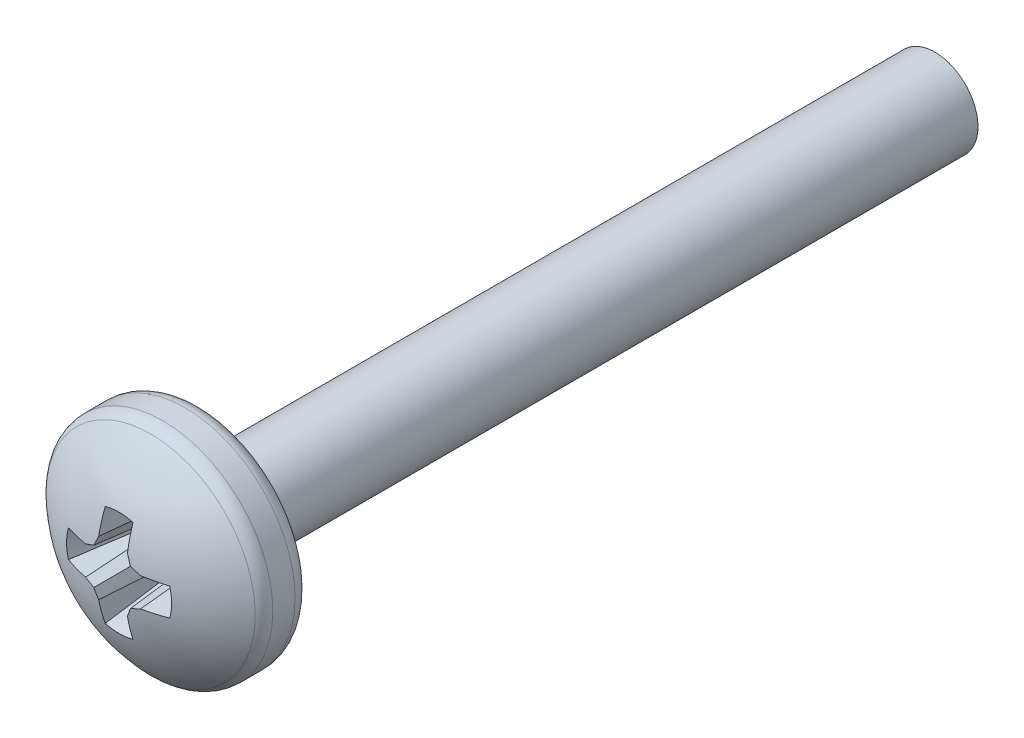
ISO-10303-21;
HEADER;
FILE_DESCRIPTION(('STEP AP214'),'2;1');
FILE_NAME('part.step','',(''),(''),'','','');
FILE_SCHEMA(('AUTOMOTIVE_DESIGN { 1 0 10303 214 1 1 1 1 }'));
ENDSEC;
DATA;
#1=APPLICATION_CONTEXT('core data for automotive mechanical design processes');
#2=APPLICATION_PROTOCOL_DEFINITION('international standard','automotive_design',2000,#1);
#3=PRODUCT_CONTEXT('',#1,'mechanical');
#4=PRODUCT('Part','Part','',(#3));
#5=PRODUCT_RELATED_PRODUCT_CATEGORY('part','',(#4));
#6=PRODUCT_DEFINITION_FORMATION('','',#4);
#7=PRODUCT_DEFINITION_CONTEXT('part definition',#1,'design');
#8=PRODUCT_DEFINITION('design','',#6,#7);
#9=PRODUCT_DEFINITION_SHAPE('','',#8);
#10=(LENGTH_UNIT() NAMED_UNIT(*) SI_UNIT(.MILLI.,.METRE.));
#11=(NAMED_UNIT(*) PLANE_ANGLE_UNIT() SI_UNIT($,.RADIAN.));
#12=(NAMED_UNIT(*) SI_UNIT($,.STERADIAN.) SOLID_ANGLE_UNIT());
#13=UNCERTAINTY_MEASURE_WITH_UNIT(LENGTH_MEASURE(1.E-05),#10,'distance_accuracy_value','');
#14=(GEOMETRIC_REPRESENTATION_CONTEXT(3) GLOBAL_UNCERTAINTY_ASSIGNED_CONTEXT((#13)) GLOBAL_UNIT_ASSIGNED_CONTEXT((#10,
#11,#12)) REPRESENTATION_CONTEXT('',''));
#15=CARTESIAN_POINT('',(0.,0.,0.));
#16=DIRECTION('',(0.,0.,1.));
#17=DIRECTION('',(1.,0.,0.));
#18=AXIS2_PLACEMENT_3D('',#15,#16,#17);
#19=CARTESIAN_POINT('',(0.,0.,20.));
#20=DIRECTION('',(0.,0.,-1.));
#21=DIRECTION('',(-1.,0.,0.));
#22=AXIS2_PLACEMENT_3D('',#19,#20,#21);
#23=PLANE('',#22);
#24=CARTESIAN_POINT('',(0.,0.,20.));
#25=DIRECTION('',(0.,0.,1.));
#26=DIRECTION('',(1.,0.,0.));
#27=AXIS2_PLACEMENT_3D('',#24,#25,#26);
#28=CIRCLE('',#27,1.17524047358083);
#29=CARTESIAN_POINT('',(1.17524047358083,0.,20.));
#30=VERTEX_POINT('',#29);
#31=EDGE_CURVE('E725',#30,#30,#28,.T.);
#32=ORIENTED_EDGE('',*,*,#31,.T.);
#33=EDGE_LOOP('',(#32));
#34=FACE_BOUND('',#33,.T.);
#35=CARTESIAN_POINT('',(0.,0.,20.));
#36=DIRECTION('',(0.,0.,1.));
#37=DIRECTION('',(0.,-1.,0.));
#38=AXIS2_PLACEMENT_3D('',#35,#36,#37);
#39=CIRCLE('',#38,2.55);
#40=CARTESIAN_POINT('',(0.,-2.55000000000001,20.));
#41=VERTEX_POINT('',#40);
#42=EDGE_CURVE('E711',#41,#41,#39,.T.);
#43=ORIENTED_EDGE('',*,*,#42,.F.);
#44=EDGE_LOOP('',(#43));
#45=FACE_BOUND('',#44,.T.);
#46=ADVANCED_FACE('F37',(#34,#45),#23,.T.);
#47=CARTESIAN_POINT('',(0.,0.,0.));
#48=DIRECTION('',(0.,0.,1.));
#49=DIRECTION('',(1.,0.,0.));
#50=AXIS2_PLACEMENT_3D('',#47,#48,#49);
#51=PLANE('',#50);
#52=CARTESIAN_POINT('',(0.,0.,0.));
#53=DIRECTION('',(0.,0.,1.));
#54=DIRECTION('',(1.,0.,0.));
#55=AXIS2_PLACEMENT_3D('',#52,#53,#54);
#56=CIRCLE('',#55,1.17524047358084);
#57=CARTESIAN_POINT('',(1.17524047358084,0.,0.));
#58=VERTEX_POINT('',#57);
#59=EDGE_CURVE('E387',#58,#58,#56,.T.);
#60=ORIENTED_EDGE('',*,*,#59,.F.);
#61=EDGE_LOOP('',(#60));
#62=FACE_BOUND('',#61,.T.);
#63=ADVANCED_FACE('F223',(#62),#51,.F.);
#64=CARTESIAN_POINT('',(0.,0.,0.));
#65=DIRECTION('',(0.,0.,1.));
#66=DIRECTION('',(1.,0.,0.));
#67=AXIS2_PLACEMENT_3D('',#64,#65,#66);
#68=CYLINDRICAL_SURFACE('',#67,1.17524047358084);
#69=ORIENTED_EDGE('',*,*,#31,.F.);
#70=EDGE_LOOP('',(#69));
#71=FACE_BOUND('',#70,.T.);
#72=ORIENTED_EDGE('',*,*,#59,.T.);
#73=EDGE_LOOP('',(#72));
#74=FACE_BOUND('',#73,.T.);
#75=ADVANCED_FACE('F229',(#71,#74),#68,.T.);
#76=CARTESIAN_POINT('',(0.,0.,20.45));
#77=DIRECTION('',(0.,0.,1.));
#78=DIRECTION('',(0.,-1.,0.));
#79=AXIS2_PLACEMENT_3D('',#76,#77,#78);
#80=TOROIDAL_SURFACE('',#79,2.55,0.449999999999999);
#81=ORIENTED_EDGE('',*,*,#42,.T.);
#82=EDGE_LOOP('',(#81));
#83=FACE_BOUND('',#82,.T.);
#84=CARTESIAN_POINT('',(0.,0.,20.45));
#85=DIRECTION('',(0.,0.,1.));
#86=DIRECTION('',(0.,-1.,0.));
#87=AXIS2_PLACEMENT_3D('',#84,#85,#86);
#88=CIRCLE('',#87,3.);
#89=CARTESIAN_POINT('',(0.,-3.00000000000001,20.45));
#90=VERTEX_POINT('',#89);
#91=EDGE_CURVE('E714',#90,#90,#88,.T.);
#92=ORIENTED_EDGE('',*,*,#91,.F.);
#93=EDGE_LOOP('',(#92));
#94=FACE_BOUND('',#93,.T.);
#95=ADVANCED_FACE('F240',(#83,#94),#80,.T.);
#96=CARTESIAN_POINT('',(0.,0.,0.));
#97=DIRECTION('',(0.,0.,-1.));
#98=DIRECTION('',(-1.,0.,0.));
#99=AXIS2_PLACEMENT_3D('',#96,#97,#98);
#100=CYLINDRICAL_SURFACE('',#99,2.99999999999999);
#101=ORIENTED_EDGE('',*,*,#91,.T.);
#102=EDGE_LOOP('',(#101));
#103=FACE_BOUND('',#102,.T.);
#104=CARTESIAN_POINT('',(0.,0.,21.0585454011027));
#105=DIRECTION('',(0.,0.,1.));
#106=DIRECTION('',(0.,-1.,0.));
#107=AXIS2_PLACEMENT_3D('',#104,#105,#106);
#108=CIRCLE('',#107,3.);
#109=CARTESIAN_POINT('',(0.,-3.00000000000001,21.0585454011027));
#110=VERTEX_POINT('',#109);
#111=EDGE_CURVE('E715',#110,#110,#108,.T.);
#112=ORIENTED_EDGE('',*,*,#111,.F.);
#113=EDGE_LOOP('',(#112));
#114=FACE_BOUND('',#113,.T.);
#115=ADVANCED_FACE('F237',(#103,#114),#100,.T.);
#116=CARTESIAN_POINT('',(0.,0.,18.275));
#117=DIRECTION('',(0.,0.,1.));
#118=DIRECTION('',(0.,1.,0.));
#119=AXIS2_PLACEMENT_3D('',#116,#117,#118);
#120=SPHERICAL_SURFACE('',#119,4.225);
#121=CARTESIAN_POINT('',(0.,0.,22.2495955953641));
#122=DIRECTION('',(0.,0.,-1.));
#123=DIRECTION('',(-1.,0.,0.));
#124=AXIS2_PLACEMENT_3D('',#121,#122,#123);
#125=CIRCLE('',#124,1.4329043419966);
#126=CARTESIAN_POINT('',(1.38212190130692,-0.378092453297411,22.2495955953641));
#127=VERTEX_POINT('',#126);
#128=CARTESIAN_POINT('',(1.38212190130692,0.378092453297393,22.2495955953641));
#129=VERTEX_POINT('',#128);
#130=EDGE_CURVE('E375',#127,#129,#125,.F.);
#131=ORIENTED_EDGE('',*,*,#130,.F.);
#132=CARTESIAN_POINT('',(0.,-0.0301297752810587,18.2723639862283));
#133=DIRECTION('',(0.,0.996194698091746,0.0871557427476588));
#134=DIRECTION('',(0.,-0.0871557427476588,0.996194698091746));
#135=AXIS2_PLACEMENT_3D('',#132,#133,#134);
#136=CIRCLE('',#135,4.22489174394716);
#137=CARTESIAN_POINT('',(0.74851378936592,-0.392528314585643,22.414598244924));
#138=VERTEX_POINT('',#137);
#139=EDGE_CURVE('E11',#138,#127,#136,.T.);
#140=ORIENTED_EDGE('',*,*,#139,.F.);
#141=CARTESIAN_POINT('',(0.108967296427391,-0.263070324890154,18.2500880170758));
#142=DIRECTION('',(-0.381227206369641,0.92036389196323,0.087155742747659));
#143=DIRECTION('',(-0.923879532511292,-0.382683432365078,0.));
#144=AXIS2_PLACEMENT_3D('',#141,#142,#143);
#145=CIRCLE('',#144,4.21532021625621);
#146=CARTESIAN_POINT('',(0.498545645256693,-0.498545645256698,22.4407567714872));
#147=VERTEX_POINT('',#146);
#148=EDGE_CURVE('E47',#147,#138,#145,.T.);
#149=ORIENTED_EDGE('',*,*,#148,.F.);
#150=CARTESIAN_POINT('',(0.263070324890149,-0.108967296427404,18.2500880170758));
#151=DIRECTION('',(-0.920363891963226,0.381227206369651,0.087155742747659));
#152=DIRECTION('',(-0.382683432365087,-0.923879532511288,0.));
#153=AXIS2_PLACEMENT_3D('',#150,#151,#152);
#154=CIRCLE('',#153,4.21532021625621);
#155=CARTESIAN_POINT('',(0.392528314585635,-0.748513789365924,22.414598244924));
#156=VERTEX_POINT('',#155);
#157=EDGE_CURVE('E396',#156,#147,#154,.T.);
#158=ORIENTED_EDGE('',*,*,#157,.F.);
#159=CARTESIAN_POINT('',(0.0301297752810564,0.,18.2723639862283));
#160=DIRECTION('',(-0.996194698091746,0.,0.0871557427476588));
#161=DIRECTION('',(0.0871557427476588,0.,0.996194698091746));
#162=AXIS2_PLACEMENT_3D('',#159,#160,#161);
#163=CIRCLE('',#162,4.22489174394716);
#164=CARTESIAN_POINT('',(0.378092453297399,-1.38212190130693,22.2495955953641));
#165=VERTEX_POINT('',#164);
#166=EDGE_CURVE('E355',#165,#156,#163,.T.);
#167=ORIENTED_EDGE('',*,*,#166,.F.);
#168=CARTESIAN_POINT('',(0.,0.,22.2495955953641));
#169=DIRECTION('',(0.,0.,-1.));
#170=DIRECTION('',(0.,1.,0.));
#171=AXIS2_PLACEMENT_3D('',#168,#169,#170);
#172=CIRCLE('',#171,1.4329043419966);
#173=CARTESIAN_POINT('',(-0.378092453297405,-1.38212190130693,22.2495955953641));
#174=VERTEX_POINT('',#173);
#175=EDGE_CURVE('E401',#174,#165,#172,.F.);
#176=ORIENTED_EDGE('',*,*,#175,.F.);
#177=CARTESIAN_POINT('',(-0.0301297752810505,0.,18.2723639862283));
#178=DIRECTION('',(0.996194698091746,0.,0.0871557427476584));
#179=DIRECTION('',(0.0871557427476584,0.,-0.996194698091746));
#180=AXIS2_PLACEMENT_3D('',#177,#178,#179);
#181=CIRCLE('',#180,4.22489174394716);
#182=CARTESIAN_POINT('',(-0.392528314585635,-0.748513789365929,22.414598244924));
#183=VERTEX_POINT('',#182);
#184=EDGE_CURVE('E335',#183,#174,#181,.T.);
#185=ORIENTED_EDGE('',*,*,#184,.F.);
#186=CARTESIAN_POINT('',(-0.263070324890146,-0.108967296427398,18.2500880170758));
#187=DIRECTION('',(0.920363891963231,0.381227206369638,0.0871557427476587));
#188=DIRECTION('',(-0.382683432365074,0.923879532511293,0.));
#189=AXIS2_PLACEMENT_3D('',#186,#187,#188);
#190=CIRCLE('',#189,4.21532021625621);
#191=CARTESIAN_POINT('',(-0.498545645256689,-0.498545645256701,22.4407567714872));
#192=VERTEX_POINT('',#191);
#193=EDGE_CURVE('E417',#192,#183,#190,.T.);
#194=ORIENTED_EDGE('',*,*,#193,.F.);
#195=CARTESIAN_POINT('',(-0.108967296427396,-0.263070324890157,18.2500880170758));
#196=DIRECTION('',(0.381227206369654,0.920363891963224,0.0871557427476592));
#197=DIRECTION('',(-0.923879532511287,0.38268343236509,0.));
#198=AXIS2_PLACEMENT_3D('',#195,#196,#197);
#199=CIRCLE('',#198,4.21532021625621);
#200=CARTESIAN_POINT('',(-0.748513789365915,-0.392528314585643,22.414598244924));
#201=VERTEX_POINT('',#200);
#202=EDGE_CURVE('E418',#201,#192,#199,.T.);
#203=ORIENTED_EDGE('',*,*,#202,.F.);
#204=CARTESIAN_POINT('',(0.,-0.0301297752810648,18.2723639862283));
#205=DIRECTION('',(0.,0.996194698091745,0.0871557427476593));
#206=DIRECTION('',(0.,-0.0871557427476593,0.996194698091745));
#207=AXIS2_PLACEMENT_3D('',#204,#205,#206);
#208=CIRCLE('',#207,4.22489174394716);
#209=CARTESIAN_POINT('',(-1.38212190130693,-0.378092453297404,22.2495955953641));
#210=VERTEX_POINT('',#209);
#211=EDGE_CURVE('E313',#210,#201,#208,.T.);
#212=ORIENTED_EDGE('',*,*,#211,.F.);
#213=CARTESIAN_POINT('',(0.,0.,22.2495955953641));
#214=DIRECTION('',(0.,0.,-1.));
#215=DIRECTION('',(-1.,0.,0.));
#216=AXIS2_PLACEMENT_3D('',#213,#214,#215);
#217=CIRCLE('',#216,1.4329043419966);
#218=CARTESIAN_POINT('',(-1.38212190130692,0.3780924532974,22.2495955953641));
#219=VERTEX_POINT('',#218);
#220=EDGE_CURVE('E190',#219,#210,#217,.F.);
#221=ORIENTED_EDGE('',*,*,#220,.F.);
#222=CARTESIAN_POINT('',(0.,0.0301297752810422,18.2723639862283));
#223=DIRECTION('',(0.,-0.996194698091746,0.0871557427476579));
#224=DIRECTION('',(0.,-0.0871557427476579,-0.996194698091746));
#225=AXIS2_PLACEMENT_3D('',#222,#223,#224);
#226=CIRCLE('',#225,4.22489174394716);
#227=CARTESIAN_POINT('',(-0.748513789365917,0.392528314585627,22.414598244924));
#228=VERTEX_POINT('',#227);
#229=EDGE_CURVE('E187',#228,#219,#226,.T.);
#230=ORIENTED_EDGE('',*,*,#229,.F.);
#231=CARTESIAN_POINT('',(-0.108967296427389,0.263070324890138,18.2500880170758));
#232=DIRECTION('',(0.381227206369635,-0.920363891963232,0.0871557427476581));
#233=DIRECTION('',(0.923879532511294,0.382683432365071,0.));
#234=AXIS2_PLACEMENT_3D('',#231,#232,#233);
#235=CIRCLE('',#234,4.21532021625621);
#236=CARTESIAN_POINT('',(-0.49854564525669,0.498545645256681,22.4407567714872));
#237=VERTEX_POINT('',#236);
#238=EDGE_CURVE('E186',#237,#228,#235,.T.);
#239=ORIENTED_EDGE('',*,*,#238,.F.);
#240=CARTESIAN_POINT('',(-0.263070324890148,0.108967296427389,18.2500880170758));
#241=DIRECTION('',(0.920363891963223,-0.381227206369657,0.0871557427476586));
#242=DIRECTION('',(0.382683432365094,0.923879532511285,0.));
#243=AXIS2_PLACEMENT_3D('',#240,#241,#242);
#244=CIRCLE('',#243,4.21532021625621);
#245=CARTESIAN_POINT('',(-0.39252831458563,0.748513789365906,22.414598244924));
#246=VERTEX_POINT('',#245);
#247=EDGE_CURVE('E41',#246,#237,#244,.T.);
#248=ORIENTED_EDGE('',*,*,#247,.F.);
#249=CARTESIAN_POINT('',(-0.0301297752810564,0.,18.2723639862283));
#250=DIRECTION('',(0.996194698091746,0.,0.0871557427476588));
#251=DIRECTION('',(0.0871557427476588,0.,-0.996194698091746));
#252=AXIS2_PLACEMENT_3D('',#249,#250,#251);
#253=CIRCLE('',#252,4.22489174394716);
#254=CARTESIAN_POINT('',(-0.378092453297389,1.38212190130692,22.2495955953641));
#255=VERTEX_POINT('',#254);
#256=EDGE_CURVE('E165',#255,#246,#253,.T.);
#257=ORIENTED_EDGE('',*,*,#256,.F.);
#258=CARTESIAN_POINT('',(0.,0.,22.2495955953641));
#259=DIRECTION('',(0.,0.,-1.));
#260=DIRECTION('',(-1.,0.,0.));
#261=AXIS2_PLACEMENT_3D('',#258,#259,#260);
#262=CIRCLE('',#261,1.4329043419966);
#263=CARTESIAN_POINT('',(0.378092453297396,1.38212190130692,22.2495955953641));
#264=VERTEX_POINT('',#263);
#265=EDGE_CURVE('E174',#264,#255,#262,.F.);
#266=ORIENTED_EDGE('',*,*,#265,.F.);
#267=CARTESIAN_POINT('',(0.0301297752810505,0.,18.2723639862283));
#268=DIRECTION('',(-0.996194698091746,0.,0.0871557427476584));
#269=DIRECTION('',(0.0871557427476584,0.,0.996194698091746));
#270=AXIS2_PLACEMENT_3D('',#267,#268,#269);
#271=CIRCLE('',#270,4.22489174394716);
#272=CARTESIAN_POINT('',(0.39252831458563,0.748513789365911,22.414598244924));
#273=VERTEX_POINT('',#272);
#274=EDGE_CURVE('E56',#273,#264,#271,.T.);
#275=ORIENTED_EDGE('',*,*,#274,.F.);
#276=CARTESIAN_POINT('',(0.263070324890146,0.108967296427383,18.2500880170758));
#277=DIRECTION('',(-0.920363891963228,-0.381227206369645,0.0871557427476584));
#278=DIRECTION('',(0.382683432365081,-0.923879532511291,0.));
#279=AXIS2_PLACEMENT_3D('',#276,#277,#278);
#280=CIRCLE('',#279,4.21532021625621);
#281=CARTESIAN_POINT('',(0.498545645256686,0.498545645256684,22.4407567714872));
#282=VERTEX_POINT('',#281);
#283=EDGE_CURVE('E738',#282,#273,#280,.T.);
#284=ORIENTED_EDGE('',*,*,#283,.F.);
#285=CARTESIAN_POINT('',(0.108967296427394,0.263070324890141,18.2500880170758));
#286=DIRECTION('',(-0.381227206369648,-0.920363891963227,0.0871557427476584));
#287=DIRECTION('',(0.923879532511289,-0.382683432365084,0.));
#288=AXIS2_PLACEMENT_3D('',#285,#286,#287);
#289=CIRCLE('',#288,4.21532021625621);
#290=CARTESIAN_POINT('',(0.748513789365912,0.392528314585628,22.414598244924));
#291=VERTEX_POINT('',#290);
#292=EDGE_CURVE('E383',#291,#282,#289,.T.);
#293=ORIENTED_EDGE('',*,*,#292,.F.);
#294=CARTESIAN_POINT('',(0.,0.0301297752810481,18.2723639862283));
#295=DIRECTION('',(0.,-0.996194698091746,0.0871557427476584));
#296=DIRECTION('',(0.,-0.0871557427476584,-0.996194698091746));
#297=AXIS2_PLACEMENT_3D('',#294,#295,#296);
#298=CIRCLE('',#297,4.22489174394716);
#299=EDGE_CURVE('E386',#129,#291,#298,.T.);
#300=ORIENTED_EDGE('',*,*,#299,.F.);
#301=EDGE_LOOP('',(#131,#140,#149,#158,#167,#176,#185,#194,#203,#212,#221,#230,#239,#248,#257,
#266,#275,#284,#293,#300));
#302=FACE_BOUND('',#301,.T.);
#303=CARTESIAN_POINT('',(0.,0.,21.3903587601745));
#304=DIRECTION('',(0.,0.,1.));
#305=DIRECTION('',(0.,-1.,0.));
#306=AXIS2_PLACEMENT_3D('',#303,#304,#305);
#307=CIRCLE('',#306,2.85397350993378);
#308=CARTESIAN_POINT('',(0.,-2.85397350993378,21.3903587601745));
#309=VERTEX_POINT('',#308);
#310=EDGE_CURVE('E718',#309,#309,#307,.T.);
#311=ORIENTED_EDGE('',*,*,#310,.T.);
#312=EDGE_LOOP('',(#311));
#313=FACE_BOUND('',#312,.T.);
#314=ADVANCED_FACE('F183',(#302,#313),#120,.T.);
#315=CARTESIAN_POINT('',(0.,0.,21.0585454011027));
#316=DIRECTION('',(0.,0.,1.));
#317=DIRECTION('',(0.,-1.,0.));
#318=AXIS2_PLACEMENT_3D('',#315,#316,#317);
#319=TOROIDAL_SURFACE('',#318,2.55,0.45);
#320=ORIENTED_EDGE('',*,*,#111,.T.);
#321=EDGE_LOOP('',(#320));
#322=FACE_BOUND('',#321,.T.);
#323=ORIENTED_EDGE('',*,*,#310,.F.);
#324=EDGE_LOOP('',(#323));
#325=FACE_BOUND('',#324,.T.);
#326=ADVANCED_FACE('F523',(#322,#325),#319,.T.);
#327=CARTESIAN_POINT('',(0.,0.,22.5));
#328=DIRECTION('',(0.,0.,1.));
#329=DIRECTION('',(1.,0.,0.));
#330=AXIS2_PLACEMENT_3D('',#327,#328,#329);
#331=CONICAL_SURFACE('',#330,1.5,0.26179938779915);
#332=ORIENTED_EDGE('',*,*,#265,.T.);
#333=CARTESIAN_POINT('',(-0.378092453297389,1.38212190130693,22.2495955953641));
#334=CARTESIAN_POINT('',(-0.362062340923654,1.3356076311921,22.0663705725131));
#335=CARTESIAN_POINT('',(-0.346032432094345,1.289084122431,21.8831478761856));
#336=CARTESIAN_POINT('',(-0.313973252931829,1.19600819791575,21.5167097815745));
#337=CARTESIAN_POINT('',(-0.297943982598586,1.14945578216326,21.3334943832904));
#338=CARTESIAN_POINT('',(-0.265886309375594,1.05631160682713,20.9670735016467));
#339=CARTESIAN_POINT('',(-0.24985790648588,1.00971984724195,20.7838680182876));
#340=CARTESIAN_POINT('',(-0.217802482926881,0.916473734066473,20.417472850421));
#341=CARTESIAN_POINT('',(-0.201775462257678,0.869819380472493,20.2342831659146));
#342=CARTESIAN_POINT('',(-0.185749390712717,0.823122106605286,20.0511043299479));
#343=B_SPLINE_CURVE_WITH_KNOTS('',3,(#333,#334,#335,#336,#337,#338,#339,#340,#341,#342),
.UNSPECIFIED.,.F.,.F.,(4,2,2,2,4),(0.,0.569146341904829,1.13829265140173,1.70743898341945,
2.27658534890885),.UNSPECIFIED.);
#344=CARTESIAN_POINT('',(-0.214086590007408,0.905647899858297,20.375));
#345=VERTEX_POINT('',#344);
#346=EDGE_CURVE('E171',#345,#255,#343,.F.);
#347=ORIENTED_EDGE('',*,*,#346,.F.);
#348=CARTESIAN_POINT('',(0.,0.,20.375));
#349=DIRECTION('',(0.,0.,1.));
#350=DIRECTION('',(1.,0.,0.));
#351=AXIS2_PLACEMENT_3D('',#348,#349,#350);
#352=CIRCLE('',#351,0.930607966083862);
#353=CARTESIAN_POINT('',(0.214086590007411,0.905647899858296,20.375));
#354=VERTEX_POINT('',#353);
#355=EDGE_CURVE('E422',#354,#345,#352,.T.);
#356=ORIENTED_EDGE('',*,*,#355,.F.);
#357=CARTESIAN_POINT('',(0.456962792483321,1.61089913268972,23.1510876973957));
#358=CARTESIAN_POINT('',(0.436721485733387,1.55220180581984,22.9197285025677));
#359=CARTESIAN_POINT('',(0.416480379551549,1.49349537060349,22.6883716002436));
#360=CARTESIAN_POINT('',(0.375998829553015,1.37605248642379,22.2256653664635));
#361=CARTESIAN_POINT('',(0.35575838573629,1.31731603746172,21.9943160350072));
#362=CARTESIAN_POINT('',(0.315278419319799,1.1998013218432,21.5316279016527));
#363=CARTESIAN_POINT('',(0.295038896720063,1.14102305518539,21.3002890997548));
#364=CARTESIAN_POINT('',(0.254561412451838,1.02339577207248,20.8376293374848));
#365=CARTESIAN_POINT('',(0.234323450783418,0.964546755614234,20.6063083771135));
#366=CARTESIAN_POINT('',(0.214086590007411,0.905647899858296,20.375));
#367=B_SPLINE_CURVE_WITH_KNOTS('',3,(#357,#358,#359,#360,#361,#362,#363,#364,#365,#366),
.UNSPECIFIED.,.F.,.F.,(4,2,2,2,4),(0.,0.718637234139723,1.43727443775383,2.1559116647132,
2.87454892356989),.UNSPECIFIED.);
#368=EDGE_CURVE('E720',#354,#264,#367,.F.);
#369=ORIENTED_EDGE('',*,*,#368,.T.);
#370=EDGE_LOOP('',(#332,#347,#356,#369));
#371=FACE_BOUND('',#370,.T.);
#372=ADVANCED_FACE('F252',(#371),#331,.F.);
#373=CARTESIAN_POINT('',(0.4,0.,22.5));
#374=DIRECTION('',(-0.996194698091746,0.,0.0871557427476584));
#375=DIRECTION('',(0.0871557427476584,0.,0.996194698091746));
#376=AXIS2_PLACEMENT_3D('',#373,#374,#375);
#377=PLANE('',#376);
#378=ORIENTED_EDGE('',*,*,#274,.T.);
#379=ORIENTED_EDGE('',*,*,#368,.F.);
#380=DIRECTION('',(0.,-1.,0.));
#381=VECTOR('',#380,1.);
#382=CARTESIAN_POINT('',(0.214086590007411,0.,20.375));
#383=LINE('',#382,#381);
#384=CARTESIAN_POINT('',(0.214086590007411,0.713019523490749,20.375));
#385=VERTEX_POINT('',#384);
#386=EDGE_CURVE('E424',#385,#354,#383,.F.);
#387=ORIENTED_EDGE('',*,*,#386,.F.);
#388=DIRECTION('',(0.0871426484044397,0.0173337504938598,0.996045029063886));
#389=VECTOR('',#388,1.);
#390=CARTESIAN_POINT('',(0.398867118306387,0.749774655820362,22.4870511029892));
#391=LINE('',#390,#389);
#392=EDGE_CURVE('E735',#385,#273,#391,.T.);
#393=ORIENTED_EDGE('',*,*,#392,.T.);
#394=EDGE_LOOP('',(#378,#379,#387,#393));
#395=FACE_BOUND('',#394,.T.);
#396=ADVANCED_FACE('F510',(#395),#377,.T.);
#397=CARTESIAN_POINT('',(0.606586399182262,0.251256313292346,22.5));
#398=DIRECTION('',(-0.920363891963228,-0.381227206369645,0.0871557427476584));
#399=DIRECTION('',(0.382683432365081,-0.923879532511291,0.));
#400=AXIS2_PLACEMENT_3D('',#397,#398,#399);
#401=PLANE('',#400);
#402=ORIENTED_EDGE('',*,*,#283,.T.);
#403=ORIENTED_EDGE('',*,*,#392,.F.);
#404=DIRECTION('',(0.382683432365081,-0.923879532511291,0.));
#405=VECTOR('',#404,1.);
#406=CARTESIAN_POINT('',(0.434824804870729,0.180110331433686,20.375));
#407=LINE('',#406,#405);
#408=CARTESIAN_POINT('',(0.360220662867382,0.360220662867381,20.375));
#409=VERTEX_POINT('',#408);
#410=EDGE_CURVE('E754',#409,#385,#407,.F.);
#411=ORIENTED_EDGE('',*,*,#410,.F.);
#412=DIRECTION('',(0.0666626913468327,0.0666626913468325,0.995546167269401));
#413=VECTOR('',#412,1.);
#414=CARTESIAN_POINT('',(0.501858559970093,0.501858559970092,22.4902321148732));
#415=LINE('',#414,#413);
#416=EDGE_CURVE('E732',#409,#282,#415,.T.);
#417=ORIENTED_EDGE('',*,*,#416,.T.);
#418=EDGE_LOOP('',(#402,#403,#411,#417));
#419=FACE_BOUND('',#418,.T.);
#420=ADVANCED_FACE('F342',(#419),#401,.T.);
#421=CARTESIAN_POINT('',(0.251256313292348,0.606586399182261,22.5));
#422=DIRECTION('',(-0.381227206369648,-0.920363891963227,0.0871557427476584));
#423=DIRECTION('',(0.923879532511289,-0.382683432365084,0.));
#424=AXIS2_PLACEMENT_3D('',#421,#422,#423);
#425=PLANE('',#424);
#426=ORIENTED_EDGE('',*,*,#292,.T.);
#427=ORIENTED_EDGE('',*,*,#416,.F.);
#428=DIRECTION('',(0.923879532511289,-0.382683432365084,0.));
#429=VECTOR('',#428,1.);
#430=CARTESIAN_POINT('',(0.180110331433687,0.434824804870729,20.375));
#431=LINE('',#430,#429);
#432=CARTESIAN_POINT('',(0.71301952349075,0.214086590007409,20.375));
#433=VERTEX_POINT('',#432);
#434=EDGE_CURVE('E380',#433,#409,#431,.F.);
#435=ORIENTED_EDGE('',*,*,#434,.F.);
#436=DIRECTION('',(0.01733375049386,0.0871426484044397,0.996045029063886));
#437=VECTOR('',#436,1.);
#438=CARTESIAN_POINT('',(0.750162198617137,0.400815427513496,22.5093203791284));
#439=LINE('',#438,#437);
#440=EDGE_CURVE('E729',#433,#291,#439,.T.);
#441=ORIENTED_EDGE('',*,*,#440,.T.);
#442=EDGE_LOOP('',(#426,#427,#435,#441));
#443=FACE_BOUND('',#442,.T.);
#444=ADVANCED_FACE('F496',(#443),#425,.T.);
#445=CARTESIAN_POINT('',(0.,0.399999999999998,22.5));
#446=DIRECTION('',(0.,-0.996194698091746,0.0871557427476584));
#447=DIRECTION('',(0.,-0.0871557427476584,-0.996194698091746));
#448=AXIS2_PLACEMENT_3D('',#445,#446,#447);
#449=PLANE('',#448);
#450=ORIENTED_EDGE('',*,*,#299,.T.);
#451=ORIENTED_EDGE('',*,*,#440,.F.);
#452=DIRECTION('',(1.,0.,0.));
#453=VECTOR('',#452,1.);
#454=CARTESIAN_POINT('',(0.,0.214086590007409,20.375));
#455=LINE('',#454,#453);
#456=CARTESIAN_POINT('',(0.905647899858297,0.214086590007409,20.375));
#457=VERTEX_POINT('',#456);
#458=EDGE_CURVE('E378',#457,#433,#455,.F.);
#459=ORIENTED_EDGE('',*,*,#458,.F.);
#460=CARTESIAN_POINT('',(1.38212190130693,0.378092453297394,22.2495955953641));
#461=CARTESIAN_POINT('',(1.3356076311921,0.362062340923658,22.0663705725131));
#462=CARTESIAN_POINT('',(1.289084122431,0.346032432094349,21.8831478761856));
#463=CARTESIAN_POINT('',(1.19600819791575,0.313973252931832,21.5167097815745));
#464=CARTESIAN_POINT('',(1.14945578216325,0.297943982598588,21.3334943832904));
#465=CARTESIAN_POINT('',(1.05631160682713,0.265886309375595,20.9670735016467));
#466=CARTESIAN_POINT('',(1.00971984724195,0.249857906485881,20.7838680182876));
#467=CARTESIAN_POINT('',(0.916473734066473,0.217802482926881,20.417472850421));
#468=CARTESIAN_POINT('',(0.869819380472494,0.201775462257678,20.2342831659146));
#469=CARTESIAN_POINT('',(0.823122106605286,0.185749390712717,20.0511043299479));
#470=B_SPLINE_CURVE_WITH_KNOTS('',3,(#460,#461,#462,#463,#464,#465,#466,#467,#468,#469),
.UNSPECIFIED.,.F.,.F.,(4,2,2,2,4),(0.,0.569146341904829,1.13829265140173,1.70743898341945,
2.27658534890885),.UNSPECIFIED.);
#471=EDGE_CURVE('E257',#457,#129,#470,.F.);
#472=ORIENTED_EDGE('',*,*,#471,.T.);
#473=EDGE_LOOP('',(#450,#451,#459,#472));
#474=FACE_BOUND('',#473,.T.);
#475=ADVANCED_FACE('F250',(#474),#449,.T.);
#476=CARTESIAN_POINT('',(0.,0.,22.5));
#477=DIRECTION('',(0.,0.,1.));
#478=DIRECTION('',(1.,0.,0.));
#479=AXIS2_PLACEMENT_3D('',#476,#477,#478);
#480=CONICAL_SURFACE('',#479,1.5,0.26179938779915);
#481=ORIENTED_EDGE('',*,*,#130,.T.);
#482=ORIENTED_EDGE('',*,*,#471,.F.);
#483=CARTESIAN_POINT('',(0.,0.,20.375));
#484=DIRECTION('',(0.,0.,1.));
#485=DIRECTION('',(1.,0.,0.));
#486=AXIS2_PLACEMENT_3D('',#483,#484,#485);
#487=CIRCLE('',#486,0.930607966083862);
#488=CARTESIAN_POINT('',(0.905647899858293,-0.214086590007423,20.375));
#489=VERTEX_POINT('',#488);
#490=EDGE_CURVE('E273',#489,#457,#487,.T.);
#491=ORIENTED_EDGE('',*,*,#490,.F.);
#492=CARTESIAN_POINT('',(1.61089913268972,-0.456962792483337,23.1510876973957));
#493=CARTESIAN_POINT('',(1.55220180581984,-0.436721485733403,22.9197285025677));
#494=CARTESIAN_POINT('',(1.49349537060349,-0.416480379551565,22.6883716002436));
#495=CARTESIAN_POINT('',(1.37605248642379,-0.37599882955303,22.2256653664635));
#496=CARTESIAN_POINT('',(1.31731603746172,-0.355758385736305,21.9943160350072));
#497=CARTESIAN_POINT('',(1.19980132184319,-0.315278419319813,21.5316279016527));
#498=CARTESIAN_POINT('',(1.14102305518538,-0.295038896720076,21.3002890997548));
#499=CARTESIAN_POINT('',(1.02339577207247,-0.254561412451851,20.8376293374848));
#500=CARTESIAN_POINT('',(0.964546755614232,-0.234323450783431,20.6063083771135));
#501=CARTESIAN_POINT('',(0.905647899858293,-0.214086590007423,20.375));
#502=B_SPLINE_CURVE_WITH_KNOTS('',3,(#492,#493,#494,#495,#496,#497,#498,#499,#500,#501),
.UNSPECIFIED.,.F.,.F.,(4,2,2,2,4),(0.,0.718637234139719,1.43727443775382,2.15591166471319,
2.87454892356988),.UNSPECIFIED.);
#503=EDGE_CURVE('E265',#489,#127,#502,.F.);
#504=ORIENTED_EDGE('',*,*,#503,.T.);
#505=EDGE_LOOP('',(#481,#482,#491,#504));
#506=FACE_BOUND('',#505,.T.);
#507=ADVANCED_FACE('F245',(#506),#480,.F.);
#508=CARTESIAN_POINT('',(0.,0.,20.375));
#509=DIRECTION('',(0.,0.,1.));
#510=DIRECTION('',(1.,0.,0.));
#511=AXIS2_PLACEMENT_3D('',#508,#509,#510);
#512=PLANE('',#511);
#513=DIRECTION('',(-1.,0.,0.));
#514=VECTOR('',#513,1.);
#515=CARTESIAN_POINT('',(0.,-0.21408659000742,20.375));
#516=LINE('',#515,#514);
#517=CARTESIAN_POINT('',(0.713019523490758,-0.214086590007423,20.375));
#518=VERTEX_POINT('',#517);
#519=EDGE_CURVE('E275',#518,#489,#516,.F.);
#520=ORIENTED_EDGE('',*,*,#519,.T.);
#521=ORIENTED_EDGE('',*,*,#490,.T.);
#522=ORIENTED_EDGE('',*,*,#458,.T.);
#523=ORIENTED_EDGE('',*,*,#434,.T.);
#524=ORIENTED_EDGE('',*,*,#410,.T.);
#525=ORIENTED_EDGE('',*,*,#386,.T.);
#526=ORIENTED_EDGE('',*,*,#355,.T.);
#527=DIRECTION('',(0.,1.,0.));
#528=VECTOR('',#527,1.);
#529=CARTESIAN_POINT('',(-0.214086590007418,0.,20.375));
#530=LINE('',#529,#528);
#531=CARTESIAN_POINT('',(-0.21408659000741,0.713019523490744,20.375));
#532=VERTEX_POINT('',#531);
#533=EDGE_CURVE('E435',#345,#532,#530,.F.);
#534=ORIENTED_EDGE('',*,*,#533,.T.);
#535=DIRECTION('',(0.382683432365094,0.923879532511285,0.));
#536=VECTOR('',#535,1.);
#537=CARTESIAN_POINT('',(-0.434824804870731,0.180110331433694,20.375));
#538=LINE('',#537,#536);
#539=CARTESIAN_POINT('',(-0.360220662867386,0.360220662867376,20.375));
#540=VERTEX_POINT('',#539);
#541=EDGE_CURVE('E178',#532,#540,#538,.F.);
#542=ORIENTED_EDGE('',*,*,#541,.T.);
#543=DIRECTION('',(0.923879532511294,0.382683432365071,0.));
#544=VECTOR('',#543,1.);
#545=CARTESIAN_POINT('',(-0.180110331433679,0.434824804870726,20.375));
#546=LINE('',#545,#544);
#547=CARTESIAN_POINT('',(-0.713019523490756,0.214086590007409,20.375));
#548=VERTEX_POINT('',#547);
#549=EDGE_CURVE('E437',#540,#548,#546,.F.);
#550=ORIENTED_EDGE('',*,*,#549,.T.);
#551=DIRECTION('',(1.,0.,0.));
#552=VECTOR('',#551,1.);
#553=CARTESIAN_POINT('',(0.,0.214086590007402,20.375));
#554=LINE('',#553,#552);
#555=CARTESIAN_POINT('',(-0.905647899858292,0.214086590007411,20.375));
#556=VERTEX_POINT('',#555);
#557=EDGE_CURVE('E204',#548,#556,#554,.F.);
#558=ORIENTED_EDGE('',*,*,#557,.T.);
#559=CARTESIAN_POINT('',(0.,0.,20.375));
#560=DIRECTION('',(0.,0.,1.));
#561=DIRECTION('',(1.,0.,0.));
#562=AXIS2_PLACEMENT_3D('',#559,#560,#561);
#563=CIRCLE('',#562,0.930607966083862);
#564=CARTESIAN_POINT('',(-0.905647899858299,-0.214086590007421,20.375));
#565=VERTEX_POINT('',#564);
#566=EDGE_CURVE('E202',#556,#565,#563,.T.);
#567=ORIENTED_EDGE('',*,*,#566,.T.);
#568=DIRECTION('',(-1.,0.,0.));
#569=VECTOR('',#568,1.);
#570=CARTESIAN_POINT('',(0.,-0.214086590007427,20.375));
#571=LINE('',#570,#569);
#572=CARTESIAN_POINT('',(-0.713019523490752,-0.214086590007422,20.375));
#573=VERTEX_POINT('',#572);
#574=EDGE_CURVE('E315',#565,#573,#571,.F.);
#575=ORIENTED_EDGE('',*,*,#574,.T.);
#576=DIRECTION('',(-0.923879532511287,0.38268343236509,0.));
#577=VECTOR('',#576,1.);
#578=CARTESIAN_POINT('',(-0.180110331433697,-0.434824804870743,20.375));
#579=LINE('',#578,#577);
#580=CARTESIAN_POINT('',(-0.360220662867384,-0.360220662867397,20.375));
#581=VERTEX_POINT('',#580);
#582=EDGE_CURVE('E318',#573,#581,#579,.F.);
#583=ORIENTED_EDGE('',*,*,#582,.T.);
#584=DIRECTION('',(-0.382683432365074,0.923879532511293,0.));
#585=VECTOR('',#584,1.);
#586=CARTESIAN_POINT('',(-0.434824804870737,-0.180110331433685,20.375));
#587=LINE('',#586,#585);
#588=CARTESIAN_POINT('',(-0.214086590007416,-0.713019523490767,20.375));
#589=VERTEX_POINT('',#588);
#590=EDGE_CURVE('E321',#581,#589,#587,.F.);
#591=ORIENTED_EDGE('',*,*,#590,.T.);
#592=DIRECTION('',(0.,1.,0.));
#593=VECTOR('',#592,1.);
#594=CARTESIAN_POINT('',(-0.214086590007411,0.,20.375));
#595=LINE('',#594,#593);
#596=CARTESIAN_POINT('',(-0.214086590007417,-0.905647899858303,20.375));
#597=VERTEX_POINT('',#596);
#598=EDGE_CURVE('E312',#589,#597,#595,.F.);
#599=ORIENTED_EDGE('',*,*,#598,.T.);
#600=CARTESIAN_POINT('',(0.,0.,20.375));
#601=DIRECTION('',(0.,0.,1.));
#602=DIRECTION('',(1.,0.,0.));
#603=AXIS2_PLACEMENT_3D('',#600,#601,#602);
#604=CIRCLE('',#603,0.930607966083862);
#605=CARTESIAN_POINT('',(0.214086590007415,-0.905647899858308,20.375));
#606=VERTEX_POINT('',#605);
#607=EDGE_CURVE('E333',#597,#606,#604,.T.);
#608=ORIENTED_EDGE('',*,*,#607,.T.);
#609=DIRECTION('',(0.,-1.,0.));
#610=VECTOR('',#609,1.);
#611=CARTESIAN_POINT('',(0.214086590007418,0.,20.375));
#612=LINE('',#611,#610);
#613=CARTESIAN_POINT('',(0.214086590007415,-0.713019523490761,20.375));
#614=VERTEX_POINT('',#613);
#615=EDGE_CURVE('E357',#606,#614,#612,.F.);
#616=ORIENTED_EDGE('',*,*,#615,.T.);
#617=DIRECTION('',(-0.382683432365087,-0.923879532511288,0.));
#618=VECTOR('',#617,1.);
#619=CARTESIAN_POINT('',(0.434824804870739,-0.180110331433693,20.375));
#620=LINE('',#619,#618);
#621=CARTESIAN_POINT('',(0.360220662867389,-0.360220662867392,20.375));
#622=VERTEX_POINT('',#621);
#623=EDGE_CURVE('E360',#614,#622,#620,.F.);
#624=ORIENTED_EDGE('',*,*,#623,.T.);
#625=DIRECTION('',(-0.923879532511292,-0.382683432365078,0.));
#626=VECTOR('',#625,1.);
#627=CARTESIAN_POINT('',(0.180110331433689,-0.434824804870741,20.375));
#628=LINE('',#627,#626);
#629=EDGE_CURVE('E362',#622,#518,#628,.F.);
#630=ORIENTED_EDGE('',*,*,#629,.T.);
#631=EDGE_LOOP('',(#520,#521,#522,#523,#524,#525,#526,#534,#542,#550,#558,#567,#575,#583,#591,
#599,#608,#616,#624,#630));
#632=FACE_BOUND('',#631,.T.);
#633=ADVANCED_FACE('F249',(#632),#512,.T.);
#634=CARTESIAN_POINT('',(0.,-0.40000000000001,22.5));
#635=DIRECTION('',(0.,0.996194698091746,0.0871557427476588));
#636=DIRECTION('',(0.,-0.0871557427476588,0.996194698091746));
#637=AXIS2_PLACEMENT_3D('',#634,#635,#636);
#638=PLANE('',#637);
#639=ORIENTED_EDGE('',*,*,#139,.T.);
#640=ORIENTED_EDGE('',*,*,#503,.F.);
#641=ORIENTED_EDGE('',*,*,#519,.F.);
#642=DIRECTION('',(0.0173337504938599,-0.0871426484044402,0.996045029063886));
#643=VECTOR('',#642,1.);
#644=CARTESIAN_POINT('',(0.749774655820371,-0.3988671183064,22.4870511029892));
#645=LINE('',#644,#643);
#646=EDGE_CURVE('E274',#518,#138,#645,.T.);
#647=ORIENTED_EDGE('',*,*,#646,.T.);
#648=EDGE_LOOP('',(#639,#640,#641,#647));
#649=FACE_BOUND('',#648,.T.);
#650=ADVANCED_FACE('F278',(#649),#638,.T.);
#651=CARTESIAN_POINT('',(0.251256313292354,-0.606586399182273,22.5));
#652=DIRECTION('',(-0.381227206369641,0.92036389196323,0.087155742747659));
#653=DIRECTION('',(-0.923879532511292,-0.382683432365078,0.));
#654=AXIS2_PLACEMENT_3D('',#651,#652,#653);
#655=PLANE('',#654);
#656=ORIENTED_EDGE('',*,*,#148,.T.);
#657=ORIENTED_EDGE('',*,*,#646,.F.);
#658=ORIENTED_EDGE('',*,*,#629,.F.);
#659=DIRECTION('',(0.0666626913468327,-0.0666626913468334,0.995546167269401));
#660=VECTOR('',#659,1.);
#661=CARTESIAN_POINT('',(0.501858559970101,-0.501858559970105,22.4902321148732));
#662=LINE('',#661,#660);
#663=EDGE_CURVE('E390',#622,#147,#662,.T.);
#664=ORIENTED_EDGE('',*,*,#663,.T.);
#665=EDGE_LOOP('',(#656,#657,#658,#664));
#666=FACE_BOUND('',#665,.T.);
#667=ADVANCED_FACE('F282',(#666),#655,.T.);
#668=CARTESIAN_POINT('',(0.606586399182271,-0.251256313292361,22.5));
#669=DIRECTION('',(-0.920363891963226,0.381227206369651,0.087155742747659));
#670=DIRECTION('',(-0.382683432365087,-0.923879532511288,0.));
#671=AXIS2_PLACEMENT_3D('',#668,#669,#670);
#672=PLANE('',#671);
#673=ORIENTED_EDGE('',*,*,#157,.T.);
#674=ORIENTED_EDGE('',*,*,#663,.F.);
#675=ORIENTED_EDGE('',*,*,#623,.F.);
#676=DIRECTION('',(0.0871426484044401,-0.0173337504938607,0.996045029063886));
#677=VECTOR('',#676,1.);
#678=CARTESIAN_POINT('',(0.400815427513504,-0.750162198617149,22.5093203791284));
#679=LINE('',#678,#677);
#680=EDGE_CURVE('E354',#614,#156,#679,.T.);
#681=ORIENTED_EDGE('',*,*,#680,.T.);
#682=EDGE_LOOP('',(#673,#674,#675,#681));
#683=FACE_BOUND('',#682,.T.);
#684=ADVANCED_FACE('F286',(#683),#672,.T.);
#685=CARTESIAN_POINT('',(0.400000000000008,0.,22.5));
#686=DIRECTION('',(-0.996194698091746,0.,0.0871557427476588));
#687=DIRECTION('',(0.0871557427476588,0.,0.996194698091746));
#688=AXIS2_PLACEMENT_3D('',#685,#686,#687);
#689=PLANE('',#688);
#690=ORIENTED_EDGE('',*,*,#166,.T.);
#691=ORIENTED_EDGE('',*,*,#680,.F.);
#692=ORIENTED_EDGE('',*,*,#615,.F.);
#693=CARTESIAN_POINT('',(0.378092453297399,-1.38212190130694,22.2495955953641));
#694=CARTESIAN_POINT('',(0.362062340923664,-1.33560763119211,22.0663705725131));
#695=CARTESIAN_POINT('',(0.346032432094355,-1.28908412243101,21.8831478761856));
#696=CARTESIAN_POINT('',(0.313973252931838,-1.19600819791576,21.5167097815745));
#697=CARTESIAN_POINT('',(0.297943982598594,-1.14945578216327,21.3334943832904));
#698=CARTESIAN_POINT('',(0.265886309375601,-1.05631160682714,20.9670735016467));
#699=CARTESIAN_POINT('',(0.249857906485887,-1.00971984724196,20.7838680182876));
#700=CARTESIAN_POINT('',(0.217802482926887,-0.916473734066483,20.417472850421));
#701=CARTESIAN_POINT('',(0.201775462257684,-0.869819380472503,20.2342831659146));
#702=CARTESIAN_POINT('',(0.185749390712723,-0.823122106605295,20.0511043299479));
#703=B_SPLINE_CURVE_WITH_KNOTS('',3,(#693,#694,#695,#696,#697,#698,#699,#700,#701,#702),
.UNSPECIFIED.,.F.,.F.,(4,2,2,2,4),(0.,0.569146341904829,1.13829265140173,1.70743898341945,
2.27658534890885),.UNSPECIFIED.);
#704=EDGE_CURVE('E346',#606,#165,#703,.F.);
#705=ORIENTED_EDGE('',*,*,#704,.T.);
#706=EDGE_LOOP('',(#690,#691,#692,#705));
#707=FACE_BOUND('',#706,.T.);
#708=ADVANCED_FACE('F284',(#707),#689,.T.);
#709=CARTESIAN_POINT('',(0.,0.,22.5));
#710=DIRECTION('',(0.,0.,1.));
#711=DIRECTION('',(0.,-1.,0.));
#712=AXIS2_PLACEMENT_3D('',#709,#710,#711);
#713=CONICAL_SURFACE('',#712,1.5,0.26179938779915);
#714=ORIENTED_EDGE('',*,*,#175,.T.);
#715=ORIENTED_EDGE('',*,*,#704,.F.);
#716=ORIENTED_EDGE('',*,*,#607,.F.);
#717=CARTESIAN_POINT('',(-0.456962792483332,-1.61089913268973,23.1510876973957));
#718=CARTESIAN_POINT('',(-0.436721485733398,-1.55220180581985,22.9197285025677));
#719=CARTESIAN_POINT('',(-0.41648037955156,-1.4934953706035,22.6883716002436));
#720=CARTESIAN_POINT('',(-0.375998829553024,-1.3760524864238,22.2256653664635));
#721=CARTESIAN_POINT('',(-0.355758385736299,-1.31731603746172,21.9943160350072));
#722=CARTESIAN_POINT('',(-0.315278419319808,-1.1998013218432,21.5316279016527));
#723=CARTESIAN_POINT('',(-0.295038896720071,-1.14102305518539,21.3002890997548));
#724=CARTESIAN_POINT('',(-0.254561412451845,-1.02339577207248,20.8376293374848));
#725=CARTESIAN_POINT('',(-0.234323450783426,-0.964546755614241,20.6063083771135));
#726=CARTESIAN_POINT('',(-0.214086590007417,-0.905647899858301,20.375));
#727=B_SPLINE_CURVE_WITH_KNOTS('',3,(#717,#718,#719,#720,#721,#722,#723,#724,#725,#726),
.UNSPECIFIED.,.F.,.F.,(4,2,2,2,4),(0.,0.718637234139723,1.43727443775382,2.15591166471319,
2.87454892356989),.UNSPECIFIED.);
#728=EDGE_CURVE('E326',#597,#174,#727,.F.);
#729=ORIENTED_EDGE('',*,*,#728,.T.);
#730=EDGE_LOOP('',(#714,#715,#716,#729));
#731=FACE_BOUND('',#730,.T.);
#732=ADVANCED_FACE('F337',(#731),#713,.F.);
#733=CARTESIAN_POINT('',(-0.4,0.,22.5));
#734=DIRECTION('',(0.996194698091746,0.,0.0871557427476584));
#735=DIRECTION('',(0.0871557427476584,0.,-0.996194698091746));
#736=AXIS2_PLACEMENT_3D('',#733,#734,#735);
#737=PLANE('',#736);
#738=ORIENTED_EDGE('',*,*,#184,.T.);
#739=ORIENTED_EDGE('',*,*,#728,.F.);
#740=ORIENTED_EDGE('',*,*,#598,.F.);
#741=DIRECTION('',(-0.0871426484044398,-0.0173337504938601,0.996045029063886));
#742=VECTOR('',#741,1.);
#743=CARTESIAN_POINT('',(-0.398867118306393,-0.74977465582038,22.4870511029892));
#744=LINE('',#743,#742);
#745=EDGE_CURVE('E334',#589,#183,#744,.T.);
#746=ORIENTED_EDGE('',*,*,#745,.T.);
#747=EDGE_LOOP('',(#738,#739,#740,#746));
#748=FACE_BOUND('',#747,.T.);
#749=ADVANCED_FACE('F299',(#748),#737,.T.);
#750=CARTESIAN_POINT('',(-0.606586399182264,-0.251256313292363,22.5));
#751=DIRECTION('',(0.920363891963231,0.381227206369638,0.0871557427476587));
#752=DIRECTION('',(-0.382683432365074,0.923879532511293,0.));
#753=AXIS2_PLACEMENT_3D('',#750,#751,#752);
#754=PLANE('',#753);
#755=ORIENTED_EDGE('',*,*,#193,.T.);
#756=ORIENTED_EDGE('',*,*,#745,.F.);
#757=ORIENTED_EDGE('',*,*,#590,.F.);
#758=DIRECTION('',(-0.0666626913468331,-0.0666626913468329,0.995546167269401));
#759=VECTOR('',#758,1.);
#760=CARTESIAN_POINT('',(-0.501858559970097,-0.501858559970109,22.4902321148732));
#761=LINE('',#760,#759);
#762=EDGE_CURVE('E405',#581,#192,#761,.T.);
#763=ORIENTED_EDGE('',*,*,#762,.T.);
#764=EDGE_LOOP('',(#755,#756,#757,#763));
#765=FACE_BOUND('',#764,.T.);
#766=ADVANCED_FACE('F449',(#765),#754,.T.);
#767=CARTESIAN_POINT('',(-0.251256313292352,-0.60658639918228,22.5));
#768=DIRECTION('',(0.381227206369654,0.920363891963224,0.0871557427476592));
#769=DIRECTION('',(-0.923879532511287,0.38268343236509,0.));
#770=AXIS2_PLACEMENT_3D('',#767,#768,#769);
#771=PLANE('',#770);
#772=ORIENTED_EDGE('',*,*,#202,.T.);
#773=ORIENTED_EDGE('',*,*,#762,.F.);
#774=ORIENTED_EDGE('',*,*,#582,.F.);
#775=DIRECTION('',(-0.0173337504938606,-0.0871426484044405,0.996045029063886));
#776=VECTOR('',#775,1.);
#777=CARTESIAN_POINT('',(-0.75016219861714,-0.400815427513512,22.5093203791284));
#778=LINE('',#777,#776);
#779=EDGE_CURVE('E311',#573,#201,#778,.T.);
#780=ORIENTED_EDGE('',*,*,#779,.T.);
#781=EDGE_LOOP('',(#772,#773,#774,#780));
#782=FACE_BOUND('',#781,.T.);
#783=ADVANCED_FACE('F297',(#782),#771,.T.);
#784=CARTESIAN_POINT('',(0.,-0.400000000000018,22.5));
#785=DIRECTION('',(0.,0.996194698091745,0.0871557427476593));
#786=DIRECTION('',(0.,-0.0871557427476593,0.996194698091745));
#787=AXIS2_PLACEMENT_3D('',#784,#785,#786);
#788=PLANE('',#787);
#789=ORIENTED_EDGE('',*,*,#211,.T.);
#790=ORIENTED_EDGE('',*,*,#779,.F.);
#791=ORIENTED_EDGE('',*,*,#574,.F.);
#792=CARTESIAN_POINT('',(-1.38212190130693,-0.378092453297404,22.2495955953641));
#793=CARTESIAN_POINT('',(-1.3356076311921,-0.362062340923669,22.0663705725131));
#794=CARTESIAN_POINT('',(-1.289084122431,-0.34603243209436,21.8831478761856));
#795=CARTESIAN_POINT('',(-1.19600819791575,-0.313973252931843,21.5167097815745));
#796=CARTESIAN_POINT('',(-1.14945578216326,-0.297943982598599,21.3334943832904));
#797=CARTESIAN_POINT('',(-1.05631160682714,-0.265886309375607,20.9670735016467));
#798=CARTESIAN_POINT('',(-1.00971984724195,-0.249857906485893,20.7838680182876));
#799=CARTESIAN_POINT('',(-0.916473734066474,-0.217802482926893,20.417472850421));
#800=CARTESIAN_POINT('',(-0.869819380472494,-0.20177546225769,20.2342831659146));
#801=CARTESIAN_POINT('',(-0.823122106605286,-0.185749390712729,20.0511043299479));
#802=B_SPLINE_CURVE_WITH_KNOTS('',3,(#792,#793,#794,#795,#796,#797,#798,#799,#800,#801),
.UNSPECIFIED.,.F.,.F.,(4,2,2,2,4),(0.,0.569146341904829,1.13829265140173,1.70743898341945,
2.27658534890885),.UNSPECIFIED.);
#803=EDGE_CURVE('E303',#565,#210,#802,.F.);
#804=ORIENTED_EDGE('',*,*,#803,.T.);
#805=EDGE_LOOP('',(#789,#790,#791,#804));
#806=FACE_BOUND('',#805,.T.);
#807=ADVANCED_FACE('F293',(#806),#788,.T.);
#808=CARTESIAN_POINT('',(0.,0.,22.5));
#809=DIRECTION('',(0.,0.,1.));
#810=DIRECTION('',(1.,0.,0.));
#811=AXIS2_PLACEMENT_3D('',#808,#809,#810);
#812=CONICAL_SURFACE('',#811,1.5,0.26179938779915);
#813=ORIENTED_EDGE('',*,*,#220,.T.);
#814=ORIENTED_EDGE('',*,*,#803,.F.);
#815=ORIENTED_EDGE('',*,*,#566,.F.);
#816=CARTESIAN_POINT('',(-1.61089913268972,0.456962792483327,23.1510876973957));
#817=CARTESIAN_POINT('',(-1.55220180581984,0.436721485733393,22.9197285025677));
#818=CARTESIAN_POINT('',(-1.49349537060348,0.416480379551555,22.6883716002436));
#819=CARTESIAN_POINT('',(-1.37605248642378,0.375998829553019,22.2256653664635));
#820=CARTESIAN_POINT('',(-1.31731603746171,0.355758385736294,21.9943160350072));
#821=CARTESIAN_POINT('',(-1.19980132184319,0.315278419319802,21.5316279016527));
#822=CARTESIAN_POINT('',(-1.14102305518538,0.295038896720065,21.3002890997548));
#823=CARTESIAN_POINT('',(-1.02339577207247,0.254561412451839,20.8376293374848));
#824=CARTESIAN_POINT('',(-0.96454675561423,0.234323450783419,20.6063083771135));
#825=CARTESIAN_POINT('',(-0.905647899858291,0.214086590007411,20.375));
#826=B_SPLINE_CURVE_WITH_KNOTS('',3,(#816,#817,#818,#819,#820,#821,#822,#823,#824,#825),
.UNSPECIFIED.,.F.,.F.,(4,2,2,2,4),(0.,0.718637234139723,1.43727443775382,2.15591166471319,
2.87454892356989),.UNSPECIFIED.);
#827=EDGE_CURVE('E193',#556,#219,#826,.F.);
#828=ORIENTED_EDGE('',*,*,#827,.T.);
#829=EDGE_LOOP('',(#813,#814,#815,#828));
#830=FACE_BOUND('',#829,.T.);
#831=ADVANCED_FACE('F206',(#830),#812,.F.);
#832=CARTESIAN_POINT('',(0.,0.39999999999999,22.5));
#833=DIRECTION('',(0.,-0.996194698091746,0.0871557427476579));
#834=DIRECTION('',(0.,-0.0871557427476579,-0.996194698091746));
#835=AXIS2_PLACEMENT_3D('',#832,#833,#834);
#836=PLANE('',#835);
#837=ORIENTED_EDGE('',*,*,#229,.T.);
#838=ORIENTED_EDGE('',*,*,#827,.F.);
#839=ORIENTED_EDGE('',*,*,#557,.F.);
#840=DIRECTION('',(-0.0173337504938593,0.0871426484044394,0.996045029063886));
#841=VECTOR('',#840,1.);
#842=CARTESIAN_POINT('',(-0.749774655820368,0.398867118306385,22.4870511029892));
#843=LINE('',#842,#841);
#844=EDGE_CURVE('E203',#548,#228,#843,.T.);
#845=ORIENTED_EDGE('',*,*,#844,.T.);
#846=EDGE_LOOP('',(#837,#838,#839,#845));
#847=FACE_BOUND('',#846,.T.);
#848=ADVANCED_FACE('F210',(#847),#836,.T.);
#849=CARTESIAN_POINT('',(-0.25125631329235,0.606586399182254,22.5));
#850=DIRECTION('',(0.381227206369635,-0.920363891963232,0.0871557427476581));
#851=DIRECTION('',(0.923879532511294,0.382683432365071,0.));
#852=AXIS2_PLACEMENT_3D('',#849,#850,#851);
#853=PLANE('',#852);
#854=ORIENTED_EDGE('',*,*,#238,.T.);
#855=ORIENTED_EDGE('',*,*,#844,.F.);
#856=ORIENTED_EDGE('',*,*,#549,.F.);
#857=DIRECTION('',(-0.0666626913468322,0.0666626913468329,0.995546167269401));
#858=VECTOR('',#857,1.);
#859=CARTESIAN_POINT('',(-0.501858559970097,0.501858559970088,22.4902321148732));
#860=LINE('',#859,#858);
#861=EDGE_CURVE('E180',#540,#237,#860,.T.);
#862=ORIENTED_EDGE('',*,*,#861,.T.);
#863=EDGE_LOOP('',(#854,#855,#856,#862));
#864=FACE_BOUND('',#863,.T.);
#865=ADVANCED_FACE('F39',(#864),#853,.T.);
#866=CARTESIAN_POINT('',(-0.606586399182269,0.251256313292344,22.5));
#867=DIRECTION('',(0.920363891963223,-0.381227206369657,0.0871557427476586));
#868=DIRECTION('',(0.382683432365094,0.923879532511285,0.));
#869=AXIS2_PLACEMENT_3D('',#866,#867,#868);
#870=PLANE('',#869);
#871=ORIENTED_EDGE('',*,*,#247,.T.);
#872=ORIENTED_EDGE('',*,*,#861,.F.);
#873=ORIENTED_EDGE('',*,*,#541,.F.);
#874=DIRECTION('',(-0.08714264840444,0.0173337504938604,0.996045029063886));
#875=VECTOR('',#874,1.);
#876=CARTESIAN_POINT('',(-0.400815427513499,0.750162198617131,22.5093203791284));
#877=LINE('',#876,#875);
#878=EDGE_CURVE('E168',#532,#246,#877,.T.);
#879=ORIENTED_EDGE('',*,*,#878,.T.);
#880=EDGE_LOOP('',(#871,#872,#873,#879));
#881=FACE_BOUND('',#880,.T.);
#882=ADVANCED_FACE('F176',(#881),#870,.T.);
#883=CARTESIAN_POINT('',(-0.400000000000008,0.,22.5));
#884=DIRECTION('',(0.996194698091746,0.,0.0871557427476588));
#885=DIRECTION('',(0.0871557427476588,0.,-0.996194698091746));
#886=AXIS2_PLACEMENT_3D('',#883,#884,#885);
#887=PLANE('',#886);
#888=ORIENTED_EDGE('',*,*,#256,.T.);
#889=ORIENTED_EDGE('',*,*,#878,.F.);
#890=ORIENTED_EDGE('',*,*,#533,.F.);
#891=ORIENTED_EDGE('',*,*,#346,.T.);
#892=EDGE_LOOP('',(#888,#889,#890,#891));
#893=FACE_BOUND('',#892,.T.);
#894=ADVANCED_FACE('F166',(#893),#887,.T.);
#895=CLOSED_SHELL('',(#46,#63,#75,#95,#115,#314,#326,#372,#396,#420,#444,#475,#507,#633,#650,
#667,#684,#708,#732,#749,#766,#783,#807,#831,#848,#865,#882,#894));
#896=MANIFOLD_SOLID_BREP('B2',#895);
#897=ADVANCED_BREP_SHAPE_REPRESENTATION('',(#18,#896),#14);
#898=SHAPE_DEFINITION_REPRESENTATION(#9,#897);
ENDSEC;
END-ISO-10303-21;
